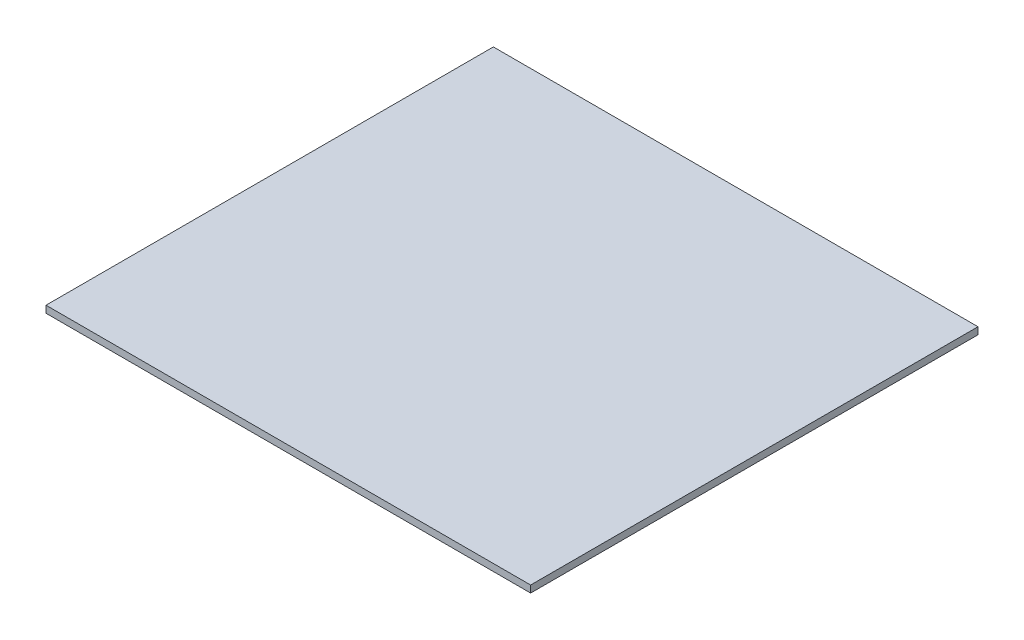
ISO-10303-21;
HEADER;
FILE_DESCRIPTION(('STEP AP214'),'2;1');
FILE_NAME('part.step','',(''),(''),'','','');
FILE_SCHEMA(('AUTOMOTIVE_DESIGN { 1 0 10303 214 1 1 1 1 }'));
ENDSEC;
DATA;
#1=APPLICATION_CONTEXT('core data for automotive mechanical design processes');
#2=APPLICATION_PROTOCOL_DEFINITION('international standard','automotive_design',2000,#1);
#3=PRODUCT_CONTEXT('',#1,'mechanical');
#4=PRODUCT('Part','Part','',(#3));
#5=PRODUCT_RELATED_PRODUCT_CATEGORY('part','',(#4));
#6=PRODUCT_DEFINITION_FORMATION('','',#4);
#7=PRODUCT_DEFINITION_CONTEXT('part definition',#1,'design');
#8=PRODUCT_DEFINITION('design','',#6,#7);
#9=PRODUCT_DEFINITION_SHAPE('','',#8);
#10=(LENGTH_UNIT() NAMED_UNIT(*) SI_UNIT(.MILLI.,.METRE.));
#11=(NAMED_UNIT(*) PLANE_ANGLE_UNIT() SI_UNIT($,.RADIAN.));
#12=(NAMED_UNIT(*) SI_UNIT($,.STERADIAN.) SOLID_ANGLE_UNIT());
#13=UNCERTAINTY_MEASURE_WITH_UNIT(LENGTH_MEASURE(1.E-05),#10,'distance_accuracy_value','');
#14=(GEOMETRIC_REPRESENTATION_CONTEXT(3) GLOBAL_UNCERTAINTY_ASSIGNED_CONTEXT((#13)) GLOBAL_UNIT_ASSIGNED_CONTEXT((#10,
#11,#12)) REPRESENTATION_CONTEXT('',''));
#15=CARTESIAN_POINT('',(0.,0.,0.));
#16=DIRECTION('',(0.,0.,1.));
#17=DIRECTION('',(1.,0.,0.));
#18=AXIS2_PLACEMENT_3D('',#15,#16,#17);
#19=CARTESIAN_POINT('',(0.,4.7625,0.));
#20=DIRECTION('',(1.,0.,0.));
#21=DIRECTION('',(0.,0.,-1.));
#22=AXIS2_PLACEMENT_3D('',#19,#20,#21);
#23=PLANE('',#22);
#24=DIRECTION('',(0.,0.,1.));
#25=VECTOR('',#24,1.);
#26=CARTESIAN_POINT('',(0.,0.,0.));
#27=LINE('',#26,#25);
#28=CARTESIAN_POINT('',(0.,0.,0.));
#29=VERTEX_POINT('',#28);
#30=CARTESIAN_POINT('',(1.29805844787961E-13,0.,304.8));
#31=VERTEX_POINT('',#30);
#32=EDGE_CURVE('E96',#29,#31,#27,.T.);
#33=ORIENTED_EDGE('',*,*,#32,.T.);
#34=DIRECTION('',(0.,-1.,0.));
#35=VECTOR('',#34,1.);
#36=CARTESIAN_POINT('',(1.29805844787961E-13,4.7625,304.8));
#37=LINE('',#36,#35);
#38=CARTESIAN_POINT('',(1.29805844787961E-13,4.7625,304.8));
#39=VERTEX_POINT('',#38);
#40=EDGE_CURVE('E11',#39,#31,#37,.T.);
#41=ORIENTED_EDGE('',*,*,#40,.F.);
#42=DIRECTION('',(0.,0.,1.));
#43=VECTOR('',#42,1.);
#44=CARTESIAN_POINT('',(0.,4.7625,0.));
#45=LINE('',#44,#43);
#46=CARTESIAN_POINT('',(0.,4.7625,0.));
#47=VERTEX_POINT('',#46);
#48=EDGE_CURVE('E82',#47,#39,#45,.T.);
#49=ORIENTED_EDGE('',*,*,#48,.F.);
#50=DIRECTION('',(0.,-1.,0.));
#51=VECTOR('',#50,1.);
#52=CARTESIAN_POINT('',(0.,4.7625,0.));
#53=LINE('',#52,#51);
#54=EDGE_CURVE('E49',#47,#29,#53,.T.);
#55=ORIENTED_EDGE('',*,*,#54,.T.);
#56=EDGE_LOOP('',(#33,#41,#49,#55));
#57=FACE_BOUND('',#56,.T.);
#58=ADVANCED_FACE('F33',(#57),#23,.F.);
#59=CARTESIAN_POINT('',(1.29805844787961E-13,4.7625,304.8));
#60=DIRECTION('',(0.,0.,-1.));
#61=DIRECTION('',(-1.,0.,0.));
#62=AXIS2_PLACEMENT_3D('',#59,#60,#61);
#63=PLANE('',#62);
#64=DIRECTION('',(1.,0.,0.));
#65=VECTOR('',#64,1.);
#66=CARTESIAN_POINT('',(1.29805844787961E-13,0.,304.8));
#67=LINE('',#66,#65);
#68=CARTESIAN_POINT('',(330.2,0.,304.8));
#69=VERTEX_POINT('',#68);
#70=EDGE_CURVE('E87',#31,#69,#67,.T.);
#71=ORIENTED_EDGE('',*,*,#70,.T.);
#72=DIRECTION('',(0.,-1.,0.));
#73=VECTOR('',#72,1.);
#74=CARTESIAN_POINT('',(330.2,4.7625,304.8));
#75=LINE('',#74,#73);
#76=CARTESIAN_POINT('',(330.2,4.7625,304.8));
#77=VERTEX_POINT('',#76);
#78=EDGE_CURVE('E41',#77,#69,#75,.T.);
#79=ORIENTED_EDGE('',*,*,#78,.F.);
#80=DIRECTION('',(1.,0.,0.));
#81=VECTOR('',#80,1.);
#82=CARTESIAN_POINT('',(1.29805844787961E-13,4.7625,304.8));
#83=LINE('',#82,#81);
#84=EDGE_CURVE('E74',#39,#77,#83,.T.);
#85=ORIENTED_EDGE('',*,*,#84,.F.);
#86=ORIENTED_EDGE('',*,*,#40,.T.);
#87=EDGE_LOOP('',(#71,#79,#85,#86));
#88=FACE_BOUND('',#87,.T.);
#89=ADVANCED_FACE('F86',(#88),#63,.F.);
#90=CARTESIAN_POINT('',(330.2,4.7625,0.));
#91=DIRECTION('',(1.,0.,0.));
#92=DIRECTION('',(0.,0.,-1.));
#93=AXIS2_PLACEMENT_3D('',#90,#91,#92);
#94=PLANE('',#93);
#95=DIRECTION('',(0.,0.,1.));
#96=VECTOR('',#95,1.);
#97=CARTESIAN_POINT('',(330.2,0.,0.));
#98=LINE('',#97,#96);
#99=CARTESIAN_POINT('',(330.2,0.,0.));
#100=VERTEX_POINT('',#99);
#101=EDGE_CURVE('E99',#100,#69,#98,.T.);
#102=ORIENTED_EDGE('',*,*,#101,.F.);
#103=DIRECTION('',(0.,-1.,0.));
#104=VECTOR('',#103,1.);
#105=CARTESIAN_POINT('',(330.2,4.7625,0.));
#106=LINE('',#105,#104);
#107=CARTESIAN_POINT('',(330.2,4.7625,0.));
#108=VERTEX_POINT('',#107);
#109=EDGE_CURVE('E63',#108,#100,#106,.T.);
#110=ORIENTED_EDGE('',*,*,#109,.F.);
#111=DIRECTION('',(0.,0.,1.));
#112=VECTOR('',#111,1.);
#113=CARTESIAN_POINT('',(330.2,4.7625,0.));
#114=LINE('',#113,#112);
#115=EDGE_CURVE('E81',#108,#77,#114,.T.);
#116=ORIENTED_EDGE('',*,*,#115,.T.);
#117=ORIENTED_EDGE('',*,*,#78,.T.);
#118=EDGE_LOOP('',(#102,#110,#116,#117));
#119=FACE_BOUND('',#118,.T.);
#120=ADVANCED_FACE('F90',(#119),#94,.T.);
#121=CARTESIAN_POINT('',(0.,4.7625,0.));
#122=DIRECTION('',(0.,0.,-1.));
#123=DIRECTION('',(-1.,0.,0.));
#124=AXIS2_PLACEMENT_3D('',#121,#122,#123);
#125=PLANE('',#124);
#126=DIRECTION('',(1.,0.,0.));
#127=VECTOR('',#126,1.);
#128=CARTESIAN_POINT('',(0.,0.,0.));
#129=LINE('',#128,#127);
#130=EDGE_CURVE('E101',#29,#100,#129,.T.);
#131=ORIENTED_EDGE('',*,*,#130,.F.);
#132=ORIENTED_EDGE('',*,*,#54,.F.);
#133=DIRECTION('',(1.,0.,0.));
#134=VECTOR('',#133,1.);
#135=CARTESIAN_POINT('',(0.,4.7625,0.));
#136=LINE('',#135,#134);
#137=EDGE_CURVE('E91',#47,#108,#136,.T.);
#138=ORIENTED_EDGE('',*,*,#137,.T.);
#139=ORIENTED_EDGE('',*,*,#109,.T.);
#140=EDGE_LOOP('',(#131,#132,#138,#139));
#141=FACE_BOUND('',#140,.T.);
#142=ADVANCED_FACE('F107',(#141),#125,.T.);
#143=CARTESIAN_POINT('',(0.,4.7625,0.));
#144=DIRECTION('',(0.,1.,0.));
#145=DIRECTION('',(0.,0.,1.));
#146=AXIS2_PLACEMENT_3D('',#143,#144,#145);
#147=PLANE('',#146);
#148=ORIENTED_EDGE('',*,*,#48,.T.);
#149=ORIENTED_EDGE('',*,*,#84,.T.);
#150=ORIENTED_EDGE('',*,*,#115,.F.);
#151=ORIENTED_EDGE('',*,*,#137,.F.);
#152=EDGE_LOOP('',(#148,#149,#150,#151));
#153=FACE_BOUND('',#152,.T.);
#154=ADVANCED_FACE('F78',(#153),#147,.T.);
#155=CARTESIAN_POINT('',(0.,0.,0.));
#156=DIRECTION('',(0.,1.,0.));
#157=DIRECTION('',(0.,0.,1.));
#158=AXIS2_PLACEMENT_3D('',#155,#156,#157);
#159=PLANE('',#158);
#160=ORIENTED_EDGE('',*,*,#32,.F.);
#161=ORIENTED_EDGE('',*,*,#130,.T.);
#162=ORIENTED_EDGE('',*,*,#101,.T.);
#163=ORIENTED_EDGE('',*,*,#70,.F.);
#164=EDGE_LOOP('',(#160,#161,#162,#163));
#165=FACE_BOUND('',#164,.T.);
#166=ADVANCED_FACE('F106',(#165),#159,.F.);
#167=CLOSED_SHELL('',(#58,#89,#120,#142,#154,#166));
#168=MANIFOLD_SOLID_BREP('B2',#167);
#169=ADVANCED_BREP_SHAPE_REPRESENTATION('',(#18,#168),#14);
#170=SHAPE_DEFINITION_REPRESENTATION(#9,#169);
ENDSEC;
END-ISO-10303-21;
